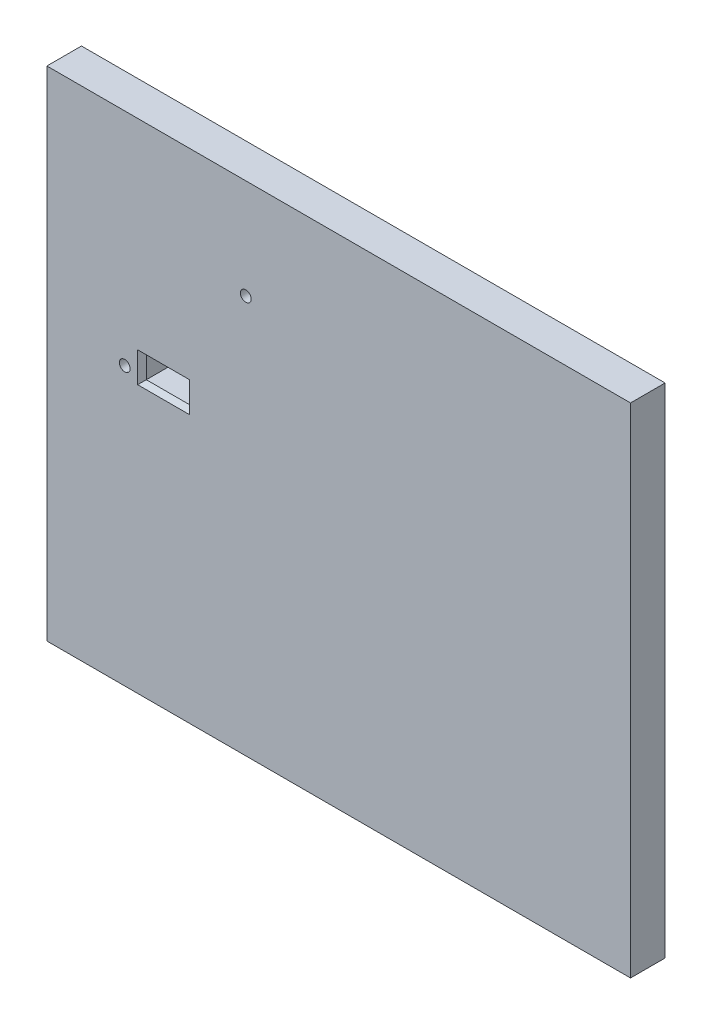
ISO-10303-21;
HEADER;
FILE_DESCRIPTION(('STEP AP214'),'2;1');
FILE_NAME('part.step','',(''),(''),'','','');
FILE_SCHEMA(('AUTOMOTIVE_DESIGN { 1 0 10303 214 1 1 1 1 }'));
ENDSEC;
DATA;
#1=APPLICATION_CONTEXT('core data for automotive mechanical design processes');
#2=APPLICATION_PROTOCOL_DEFINITION('international standard','automotive_design',2000,#1);
#3=PRODUCT_CONTEXT('',#1,'mechanical');
#4=PRODUCT('Part','Part','',(#3));
#5=PRODUCT_RELATED_PRODUCT_CATEGORY('part','',(#4));
#6=PRODUCT_DEFINITION_FORMATION('','',#4);
#7=PRODUCT_DEFINITION_CONTEXT('part definition',#1,'design');
#8=PRODUCT_DEFINITION('design','',#6,#7);
#9=PRODUCT_DEFINITION_SHAPE('','',#8);
#10=(LENGTH_UNIT() NAMED_UNIT(*) SI_UNIT(.MILLI.,.METRE.));
#11=(NAMED_UNIT(*) PLANE_ANGLE_UNIT() SI_UNIT($,.RADIAN.));
#12=(NAMED_UNIT(*) SI_UNIT($,.STERADIAN.) SOLID_ANGLE_UNIT());
#13=UNCERTAINTY_MEASURE_WITH_UNIT(LENGTH_MEASURE(1.E-05),#10,'distance_accuracy_value','');
#14=(GEOMETRIC_REPRESENTATION_CONTEXT(3) GLOBAL_UNCERTAINTY_ASSIGNED_CONTEXT((#13)) GLOBAL_UNIT_ASSIGNED_CONTEXT((#10,
#11,#12)) REPRESENTATION_CONTEXT('',''));
#15=CARTESIAN_POINT('',(0.,0.,0.));
#16=DIRECTION('',(0.,0.,1.));
#17=DIRECTION('',(1.,0.,0.));
#18=AXIS2_PLACEMENT_3D('',#15,#16,#17);
#19=CARTESIAN_POINT('',(0.,-20.,73.));
#20=DIRECTION('',(0.,-1.,0.));
#21=DIRECTION('',(1.,0.,0.));
#22=AXIS2_PLACEMENT_3D('',#19,#20,#21);
#23=PLANE('',#22);
#24=DIRECTION('',(-1.,0.,0.));
#25=VECTOR('',#24,1.);
#26=CARTESIAN_POINT('',(0.,-20.,65.));
#27=LINE('',#26,#25);
#28=CARTESIAN_POINT('',(67.5,-20.,65.));
#29=VERTEX_POINT('',#28);
#30=CARTESIAN_POINT('',(-67.5,-20.,65.));
#31=VERTEX_POINT('',#30);
#32=EDGE_CURVE('E150',#29,#31,#27,.T.);
#33=ORIENTED_EDGE('',*,*,#32,.F.);
#34=DIRECTION('',(0.,0.,-1.));
#35=VECTOR('',#34,1.);
#36=CARTESIAN_POINT('',(67.5,-20.,73.));
#37=LINE('',#36,#35);
#38=CARTESIAN_POINT('',(67.5,-20.,73.));
#39=VERTEX_POINT('',#38);
#40=EDGE_CURVE('E179',#39,#29,#37,.T.);
#41=ORIENTED_EDGE('',*,*,#40,.F.);
#42=DIRECTION('',(-1.,0.,0.));
#43=VECTOR('',#42,1.);
#44=CARTESIAN_POINT('',(0.,-20.,73.));
#45=LINE('',#44,#43);
#46=CARTESIAN_POINT('',(-67.5,-20.,73.));
#47=VERTEX_POINT('',#46);
#48=EDGE_CURVE('E155',#39,#47,#45,.T.);
#49=ORIENTED_EDGE('',*,*,#48,.T.);
#50=DIRECTION('',(0.,0.,-1.));
#51=VECTOR('',#50,1.);
#52=CARTESIAN_POINT('',(-67.5,-20.,73.));
#53=LINE('',#52,#51);
#54=EDGE_CURVE('E168',#47,#31,#53,.T.);
#55=ORIENTED_EDGE('',*,*,#54,.T.);
#56=EDGE_LOOP('',(#33,#41,#49,#55));
#57=FACE_BOUND('',#56,.T.);
#58=ADVANCED_FACE('F41',(#57),#23,.T.);
#59=CARTESIAN_POINT('',(67.5,0.,73.));
#60=DIRECTION('',(1.,0.,0.));
#61=DIRECTION('',(0.,1.,0.));
#62=AXIS2_PLACEMENT_3D('',#59,#60,#61);
#63=PLANE('',#62);
#64=DIRECTION('',(0.,-1.,0.));
#65=VECTOR('',#64,1.);
#66=CARTESIAN_POINT('',(67.5,0.,65.));
#67=LINE('',#66,#65);
#68=CARTESIAN_POINT('',(67.5,95.1987948208455,65.));
#69=VERTEX_POINT('',#68);
#70=EDGE_CURVE('E159',#69,#29,#67,.T.);
#71=ORIENTED_EDGE('',*,*,#70,.F.);
#72=DIRECTION('',(0.,0.,-1.));
#73=VECTOR('',#72,1.);
#74=CARTESIAN_POINT('',(67.5,95.1987948208455,73.));
#75=LINE('',#74,#73);
#76=CARTESIAN_POINT('',(67.5,95.1987948208455,73.));
#77=VERTEX_POINT('',#76);
#78=EDGE_CURVE('E182',#77,#69,#75,.T.);
#79=ORIENTED_EDGE('',*,*,#78,.F.);
#80=DIRECTION('',(0.,-1.,0.));
#81=VECTOR('',#80,1.);
#82=CARTESIAN_POINT('',(67.5,0.,73.));
#83=LINE('',#82,#81);
#84=EDGE_CURVE('E165',#77,#39,#83,.T.);
#85=ORIENTED_EDGE('',*,*,#84,.T.);
#86=ORIENTED_EDGE('',*,*,#40,.T.);
#87=EDGE_LOOP('',(#71,#79,#85,#86));
#88=FACE_BOUND('',#87,.T.);
#89=ADVANCED_FACE('F241',(#88),#63,.T.);
#90=CARTESIAN_POINT('',(0.,95.1987948208455,73.));
#91=DIRECTION('',(0.,1.,0.));
#92=DIRECTION('',(-1.,0.,0.));
#93=AXIS2_PLACEMENT_3D('',#90,#91,#92);
#94=PLANE('',#93);
#95=DIRECTION('',(1.,0.,0.));
#96=VECTOR('',#95,1.);
#97=CARTESIAN_POINT('',(0.,95.1987948208455,65.));
#98=LINE('',#97,#96);
#99=CARTESIAN_POINT('',(-67.5,95.1987948208455,65.));
#100=VERTEX_POINT('',#99);
#101=EDGE_CURVE('E174',#100,#69,#98,.T.);
#102=ORIENTED_EDGE('',*,*,#101,.F.);
#103=DIRECTION('',(0.,0.,-1.));
#104=VECTOR('',#103,1.);
#105=CARTESIAN_POINT('',(-67.5,95.1987948208455,73.));
#106=LINE('',#105,#104);
#107=CARTESIAN_POINT('',(-67.5,95.1987948208455,73.));
#108=VERTEX_POINT('',#107);
#109=EDGE_CURVE('E184',#108,#100,#106,.T.);
#110=ORIENTED_EDGE('',*,*,#109,.F.);
#111=DIRECTION('',(1.,0.,0.));
#112=VECTOR('',#111,1.);
#113=CARTESIAN_POINT('',(0.,95.1987948208455,73.));
#114=LINE('',#113,#112);
#115=EDGE_CURVE('E162',#108,#77,#114,.T.);
#116=ORIENTED_EDGE('',*,*,#115,.T.);
#117=ORIENTED_EDGE('',*,*,#78,.T.);
#118=EDGE_LOOP('',(#102,#110,#116,#117));
#119=FACE_BOUND('',#118,.T.);
#120=ADVANCED_FACE('F245',(#119),#94,.T.);
#121=CARTESIAN_POINT('',(-67.5,0.,73.));
#122=DIRECTION('',(-1.,0.,0.));
#123=DIRECTION('',(0.,0.,1.));
#124=AXIS2_PLACEMENT_3D('',#121,#122,#123);
#125=PLANE('',#124);
#126=DIRECTION('',(0.,1.,0.));
#127=VECTOR('',#126,1.);
#128=CARTESIAN_POINT('',(-67.5,0.,65.));
#129=LINE('',#128,#127);
#130=EDGE_CURVE('E171',#31,#100,#129,.T.);
#131=ORIENTED_EDGE('',*,*,#130,.F.);
#132=ORIENTED_EDGE('',*,*,#54,.F.);
#133=DIRECTION('',(0.,1.,0.));
#134=VECTOR('',#133,1.);
#135=CARTESIAN_POINT('',(-67.5,0.,73.));
#136=LINE('',#135,#134);
#137=EDGE_CURVE('E158',#47,#108,#136,.T.);
#138=ORIENTED_EDGE('',*,*,#137,.T.);
#139=ORIENTED_EDGE('',*,*,#109,.T.);
#140=EDGE_LOOP('',(#131,#132,#138,#139));
#141=FACE_BOUND('',#140,.T.);
#142=ADVANCED_FACE('F230',(#141),#125,.T.);
#143=CARTESIAN_POINT('',(0.,0.,73.));
#144=DIRECTION('',(0.,0.,-1.));
#145=DIRECTION('',(-1.,0.,0.));
#146=AXIS2_PLACEMENT_3D('',#143,#144,#145);
#147=PLANE('',#146);
#148=DIRECTION('',(1.,0.,0.));
#149=VECTOR('',#148,1.);
#150=CARTESIAN_POINT('',(0.,48.846,73.));
#151=LINE('',#150,#149);
#152=CARTESIAN_POINT('',(-46.5,48.846,73.));
#153=VERTEX_POINT('',#152);
#154=CARTESIAN_POINT('',(-34.5,48.846,73.));
#155=VERTEX_POINT('',#154);
#156=EDGE_CURVE('E189',#153,#155,#151,.T.);
#157=ORIENTED_EDGE('',*,*,#156,.T.);
#158=DIRECTION('',(0.,-1.,0.));
#159=VECTOR('',#158,1.);
#160=CARTESIAN_POINT('',(-34.5,0.,73.));
#161=LINE('',#160,#159);
#162=CARTESIAN_POINT('',(-34.5,41.846,73.));
#163=VERTEX_POINT('',#162);
#164=EDGE_CURVE('E195',#155,#163,#161,.T.);
#165=ORIENTED_EDGE('',*,*,#164,.T.);
#166=DIRECTION('',(-1.,0.,0.));
#167=VECTOR('',#166,1.);
#168=CARTESIAN_POINT('',(0.,41.846,73.));
#169=LINE('',#168,#167);
#170=CARTESIAN_POINT('',(-46.5,41.846,73.));
#171=VERTEX_POINT('',#170);
#172=EDGE_CURVE('E193',#163,#171,#169,.T.);
#173=ORIENTED_EDGE('',*,*,#172,.T.);
#174=DIRECTION('',(0.,1.,0.));
#175=VECTOR('',#174,1.);
#176=CARTESIAN_POINT('',(-46.5000000000001,0.,73.));
#177=LINE('',#176,#175);
#178=EDGE_CURVE('E191',#171,#153,#177,.T.);
#179=ORIENTED_EDGE('',*,*,#178,.T.);
#180=EDGE_LOOP('',(#157,#165,#173,#179));
#181=FACE_BOUND('',#180,.T.);
#182=CARTESIAN_POINT('',(-21.5,72.116,73.));
#183=DIRECTION('',(0.,0.,1.));
#184=DIRECTION('',(1.,0.,0.));
#185=AXIS2_PLACEMENT_3D('',#182,#183,#184);
#186=CIRCLE('',#185,1.25);
#187=CARTESIAN_POINT('',(-20.25,72.116,73.));
#188=VERTEX_POINT('',#187);
#189=EDGE_CURVE('E140',#188,#188,#186,.T.);
#190=ORIENTED_EDGE('',*,*,#189,.F.);
#191=EDGE_LOOP('',(#190));
#192=FACE_BOUND('',#191,.T.);
#193=CARTESIAN_POINT('',(-49.5,44.176,73.));
#194=DIRECTION('',(0.,0.,1.));
#195=DIRECTION('',(1.,0.,0.));
#196=AXIS2_PLACEMENT_3D('',#193,#194,#195);
#197=CIRCLE('',#196,1.25);
#198=CARTESIAN_POINT('',(-48.25,44.176,73.));
#199=VERTEX_POINT('',#198);
#200=EDGE_CURVE('E215',#199,#199,#197,.T.);
#201=ORIENTED_EDGE('',*,*,#200,.F.);
#202=EDGE_LOOP('',(#201));
#203=FACE_BOUND('',#202,.T.);
#204=ORIENTED_EDGE('',*,*,#48,.F.);
#205=ORIENTED_EDGE('',*,*,#84,.F.);
#206=ORIENTED_EDGE('',*,*,#115,.F.);
#207=ORIENTED_EDGE('',*,*,#137,.F.);
#208=EDGE_LOOP('',(#204,#205,#206,#207));
#209=FACE_BOUND('',#208,.T.);
#210=ADVANCED_FACE('F227',(#181,#192,#203,#209),#147,.F.);
#211=CARTESIAN_POINT('',(0.,0.,65.));
#212=DIRECTION('',(0.,0.,-1.));
#213=DIRECTION('',(-1.,0.,0.));
#214=AXIS2_PLACEMENT_3D('',#211,#212,#213);
#215=PLANE('',#214);
#216=CARTESIAN_POINT('',(-21.5,72.116,65.));
#217=DIRECTION('',(0.,0.,1.));
#218=DIRECTION('',(1.,0.,0.));
#219=AXIS2_PLACEMENT_3D('',#216,#217,#218);
#220=CIRCLE('',#219,1.25);
#221=CARTESIAN_POINT('',(-20.25,72.116,65.));
#222=VERTEX_POINT('',#221);
#223=EDGE_CURVE('E137',#222,#222,#220,.T.);
#224=ORIENTED_EDGE('',*,*,#223,.T.);
#225=EDGE_LOOP('',(#224));
#226=FACE_BOUND('',#225,.T.);
#227=CARTESIAN_POINT('',(-49.5,44.176,65.));
#228=DIRECTION('',(0.,0.,1.));
#229=DIRECTION('',(1.,0.,0.));
#230=AXIS2_PLACEMENT_3D('',#227,#228,#229);
#231=CIRCLE('',#230,1.25);
#232=CARTESIAN_POINT('',(-48.25,44.176,65.));
#233=VERTEX_POINT('',#232);
#234=EDGE_CURVE('E143',#233,#233,#231,.T.);
#235=ORIENTED_EDGE('',*,*,#234,.T.);
#236=EDGE_LOOP('',(#235));
#237=FACE_BOUND('',#236,.T.);
#238=DIRECTION('',(-1.,0.,0.));
#239=VECTOR('',#238,1.);
#240=CARTESIAN_POINT('',(-45.5,47.846,65.));
#241=LINE('',#240,#239);
#242=CARTESIAN_POINT('',(-35.5,47.846,65.));
#243=VERTEX_POINT('',#242);
#244=CARTESIAN_POINT('',(-45.5,47.846,65.));
#245=VERTEX_POINT('',#244);
#246=EDGE_CURVE('E122',#243,#245,#241,.T.);
#247=ORIENTED_EDGE('',*,*,#246,.T.);
#248=DIRECTION('',(0.,-1.,0.));
#249=VECTOR('',#248,1.);
#250=CARTESIAN_POINT('',(-45.5,47.846,65.));
#251=LINE('',#250,#249);
#252=CARTESIAN_POINT('',(-45.5,42.846,65.));
#253=VERTEX_POINT('',#252);
#254=EDGE_CURVE('E128',#245,#253,#251,.T.);
#255=ORIENTED_EDGE('',*,*,#254,.T.);
#256=DIRECTION('',(1.,0.,0.));
#257=VECTOR('',#256,1.);
#258=CARTESIAN_POINT('',(-45.5,42.846,65.));
#259=LINE('',#258,#257);
#260=CARTESIAN_POINT('',(-35.5,42.846,65.));
#261=VERTEX_POINT('',#260);
#262=EDGE_CURVE('E132',#253,#261,#259,.T.);
#263=ORIENTED_EDGE('',*,*,#262,.T.);
#264=DIRECTION('',(0.,1.,0.));
#265=VECTOR('',#264,1.);
#266=CARTESIAN_POINT('',(-35.5,47.846,65.));
#267=LINE('',#266,#265);
#268=EDGE_CURVE('E125',#261,#243,#267,.T.);
#269=ORIENTED_EDGE('',*,*,#268,.T.);
#270=EDGE_LOOP('',(#247,#255,#263,#269));
#271=FACE_BOUND('',#270,.T.);
#272=ORIENTED_EDGE('',*,*,#32,.T.);
#273=ORIENTED_EDGE('',*,*,#130,.T.);
#274=ORIENTED_EDGE('',*,*,#101,.T.);
#275=ORIENTED_EDGE('',*,*,#70,.T.);
#276=EDGE_LOOP('',(#272,#273,#274,#275));
#277=FACE_BOUND('',#276,.T.);
#278=ADVANCED_FACE('F134',(#226,#237,#271,#277),#215,.T.);
#279=CARTESIAN_POINT('',(-45.5,47.846,65.));
#280=DIRECTION('',(0.,1.,0.));
#281=DIRECTION('',(0.,0.,1.));
#282=AXIS2_PLACEMENT_3D('',#279,#280,#281);
#283=PLANE('',#282);
#284=DIRECTION('',(0.,0.,1.));
#285=VECTOR('',#284,1.);
#286=CARTESIAN_POINT('',(-35.5,47.846,65.));
#287=LINE('',#286,#285);
#288=CARTESIAN_POINT('',(-35.5,47.846,72.));
#289=VERTEX_POINT('',#288);
#290=EDGE_CURVE('E148',#243,#289,#287,.T.);
#291=ORIENTED_EDGE('',*,*,#290,.T.);
#292=DIRECTION('',(-1.,0.,0.));
#293=VECTOR('',#292,1.);
#294=CARTESIAN_POINT('',(-45.5,47.846,72.));
#295=LINE('',#294,#293);
#296=CARTESIAN_POINT('',(-45.5,47.846,72.));
#297=VERTEX_POINT('',#296);
#298=EDGE_CURVE('E11',#289,#297,#295,.T.);
#299=ORIENTED_EDGE('',*,*,#298,.T.);
#300=DIRECTION('',(0.,0.,1.));
#301=VECTOR('',#300,1.);
#302=CARTESIAN_POINT('',(-45.5,47.846,65.));
#303=LINE('',#302,#301);
#304=EDGE_CURVE('E118',#245,#297,#303,.T.);
#305=ORIENTED_EDGE('',*,*,#304,.F.);
#306=ORIENTED_EDGE('',*,*,#246,.F.);
#307=EDGE_LOOP('',(#291,#299,#305,#306));
#308=FACE_BOUND('',#307,.T.);
#309=ADVANCED_FACE('F120',(#308),#283,.F.);
#310=CARTESIAN_POINT('',(-35.5,47.846,65.));
#311=DIRECTION('',(1.,0.,0.));
#312=DIRECTION('',(0.,0.,-1.));
#313=AXIS2_PLACEMENT_3D('',#310,#311,#312);
#314=PLANE('',#313);
#315=DIRECTION('',(0.,0.,1.));
#316=VECTOR('',#315,1.);
#317=CARTESIAN_POINT('',(-35.5,42.846,65.));
#318=LINE('',#317,#316);
#319=CARTESIAN_POINT('',(-35.5,42.846,72.));
#320=VERTEX_POINT('',#319);
#321=EDGE_CURVE('E151',#261,#320,#318,.T.);
#322=ORIENTED_EDGE('',*,*,#321,.T.);
#323=DIRECTION('',(0.,1.,0.));
#324=VECTOR('',#323,1.);
#325=CARTESIAN_POINT('',(-35.5,47.846,72.));
#326=LINE('',#325,#324);
#327=EDGE_CURVE('E181',#320,#289,#326,.T.);
#328=ORIENTED_EDGE('',*,*,#327,.T.);
#329=ORIENTED_EDGE('',*,*,#290,.F.);
#330=ORIENTED_EDGE('',*,*,#268,.F.);
#331=EDGE_LOOP('',(#322,#328,#329,#330));
#332=FACE_BOUND('',#331,.T.);
#333=ADVANCED_FACE('F256',(#332),#314,.F.);
#334=CARTESIAN_POINT('',(-45.5,42.846,65.));
#335=DIRECTION('',(0.,-1.,0.));
#336=DIRECTION('',(0.,0.,-1.));
#337=AXIS2_PLACEMENT_3D('',#334,#335,#336);
#338=PLANE('',#337);
#339=DIRECTION('',(0.,0.,1.));
#340=VECTOR('',#339,1.);
#341=CARTESIAN_POINT('',(-45.5,42.846,65.));
#342=LINE('',#341,#340);
#343=CARTESIAN_POINT('',(-45.5,42.846,72.));
#344=VERTEX_POINT('',#343);
#345=EDGE_CURVE('E124',#253,#344,#342,.T.);
#346=ORIENTED_EDGE('',*,*,#345,.T.);
#347=DIRECTION('',(1.,0.,0.));
#348=VECTOR('',#347,1.);
#349=CARTESIAN_POINT('',(-45.5,42.846,72.));
#350=LINE('',#349,#348);
#351=EDGE_CURVE('E198',#344,#320,#350,.T.);
#352=ORIENTED_EDGE('',*,*,#351,.T.);
#353=ORIENTED_EDGE('',*,*,#321,.F.);
#354=ORIENTED_EDGE('',*,*,#262,.F.);
#355=EDGE_LOOP('',(#346,#352,#353,#354));
#356=FACE_BOUND('',#355,.T.);
#357=ADVANCED_FACE('F301',(#356),#338,.F.);
#358=CARTESIAN_POINT('',(-45.5,47.846,65.));
#359=DIRECTION('',(-1.,0.,0.));
#360=DIRECTION('',(0.,-1.,0.));
#361=AXIS2_PLACEMENT_3D('',#358,#359,#360);
#362=PLANE('',#361);
#363=ORIENTED_EDGE('',*,*,#304,.T.);
#364=DIRECTION('',(0.,-1.,0.));
#365=VECTOR('',#364,1.);
#366=CARTESIAN_POINT('',(-45.5,47.846,72.));
#367=LINE('',#366,#365);
#368=EDGE_CURVE('E51',#297,#344,#367,.T.);
#369=ORIENTED_EDGE('',*,*,#368,.T.);
#370=ORIENTED_EDGE('',*,*,#345,.F.);
#371=ORIENTED_EDGE('',*,*,#254,.F.);
#372=EDGE_LOOP('',(#363,#369,#370,#371));
#373=FACE_BOUND('',#372,.T.);
#374=ADVANCED_FACE('F129',(#373),#362,.F.);
#375=CARTESIAN_POINT('',(-49.5,44.176,65.));
#376=DIRECTION('',(0.,0.,1.));
#377=DIRECTION('',(1.,0.,0.));
#378=AXIS2_PLACEMENT_3D('',#375,#376,#377);
#379=CYLINDRICAL_SURFACE('',#378,1.25);
#380=ORIENTED_EDGE('',*,*,#234,.F.);
#381=EDGE_LOOP('',(#380));
#382=FACE_BOUND('',#381,.T.);
#383=ORIENTED_EDGE('',*,*,#200,.T.);
#384=EDGE_LOOP('',(#383));
#385=FACE_BOUND('',#384,.T.);
#386=ADVANCED_FACE('F292',(#382,#385),#379,.F.);
#387=CARTESIAN_POINT('',(-21.5,72.116,65.));
#388=DIRECTION('',(0.,0.,1.));
#389=DIRECTION('',(1.,0.,0.));
#390=AXIS2_PLACEMENT_3D('',#387,#388,#389);
#391=CYLINDRICAL_SURFACE('',#390,1.25);
#392=ORIENTED_EDGE('',*,*,#223,.F.);
#393=EDGE_LOOP('',(#392));
#394=FACE_BOUND('',#393,.T.);
#395=ORIENTED_EDGE('',*,*,#189,.T.);
#396=EDGE_LOOP('',(#395));
#397=FACE_BOUND('',#396,.T.);
#398=ADVANCED_FACE('F225',(#394,#397),#391,.F.);
#399=CARTESIAN_POINT('',(-45.5,47.846,72.));
#400=DIRECTION('',(-0.707106781186549,0.,-0.707106781186546));
#401=DIRECTION('',(0.,-1.,0.));
#402=AXIS2_PLACEMENT_3D('',#399,#400,#401);
#403=PLANE('',#402);
#404=DIRECTION('',(0.577350269189624,-0.577350269189627,-0.577350269189627));
#405=VECTOR('',#404,1.);
#406=CARTESIAN_POINT('',(-45.5,47.846,72.));
#407=LINE('',#406,#405);
#408=EDGE_CURVE('E204',#153,#297,#407,.T.);
#409=ORIENTED_EDGE('',*,*,#408,.F.);
#410=ORIENTED_EDGE('',*,*,#178,.F.);
#411=DIRECTION('',(0.577350269189625,0.577350269189626,-0.577350269189626));
#412=VECTOR('',#411,1.);
#413=CARTESIAN_POINT('',(-45.5,42.846,72.));
#414=LINE('',#413,#412);
#415=EDGE_CURVE('E46',#344,#171,#414,.F.);
#416=ORIENTED_EDGE('',*,*,#415,.F.);
#417=ORIENTED_EDGE('',*,*,#368,.F.);
#418=EDGE_LOOP('',(#409,#410,#416,#417));
#419=FACE_BOUND('',#418,.T.);
#420=ADVANCED_FACE('F44',(#419),#403,.F.);
#421=CARTESIAN_POINT('',(-45.5,42.846,72.));
#422=DIRECTION('',(0.,-0.707106781186547,-0.707106781186547));
#423=DIRECTION('',(1.,0.,0.));
#424=AXIS2_PLACEMENT_3D('',#421,#422,#423);
#425=PLANE('',#424);
#426=ORIENTED_EDGE('',*,*,#415,.T.);
#427=ORIENTED_EDGE('',*,*,#172,.F.);
#428=DIRECTION('',(-0.577350269189626,0.577350269189626,-0.577350269189626));
#429=VECTOR('',#428,1.);
#430=CARTESIAN_POINT('',(-37.1666666666667,44.5126666666667,70.3333333333333));
#431=LINE('',#430,#429);
#432=EDGE_CURVE('E203',#320,#163,#431,.F.);
#433=ORIENTED_EDGE('',*,*,#432,.F.);
#434=ORIENTED_EDGE('',*,*,#351,.F.);
#435=EDGE_LOOP('',(#426,#427,#433,#434));
#436=FACE_BOUND('',#435,.T.);
#437=ADVANCED_FACE('F280',(#436),#425,.F.);
#438=CARTESIAN_POINT('',(-45.5,47.846,72.));
#439=DIRECTION('',(0.,0.707106781186547,-0.707106781186547));
#440=DIRECTION('',(-1.,0.,0.));
#441=AXIS2_PLACEMENT_3D('',#438,#439,#440);
#442=PLANE('',#441);
#443=ORIENTED_EDGE('',*,*,#408,.T.);
#444=ORIENTED_EDGE('',*,*,#298,.F.);
#445=DIRECTION('',(0.577350269189626,0.577350269189626,0.577350269189626));
#446=VECTOR('',#445,1.);
#447=CARTESIAN_POINT('',(-35.5,47.846,72.));
#448=LINE('',#447,#446);
#449=EDGE_CURVE('E201',#155,#289,#448,.F.);
#450=ORIENTED_EDGE('',*,*,#449,.F.);
#451=ORIENTED_EDGE('',*,*,#156,.F.);
#452=EDGE_LOOP('',(#443,#444,#450,#451));
#453=FACE_BOUND('',#452,.T.);
#454=ADVANCED_FACE('F274',(#453),#442,.F.);
#455=CARTESIAN_POINT('',(-35.5,47.846,72.));
#456=DIRECTION('',(0.707106781186547,0.,-0.707106781186547));
#457=DIRECTION('',(0.,1.,0.));
#458=AXIS2_PLACEMENT_3D('',#455,#456,#457);
#459=PLANE('',#458);
#460=ORIENTED_EDGE('',*,*,#432,.T.);
#461=ORIENTED_EDGE('',*,*,#164,.F.);
#462=ORIENTED_EDGE('',*,*,#449,.T.);
#463=ORIENTED_EDGE('',*,*,#327,.F.);
#464=EDGE_LOOP('',(#460,#461,#462,#463));
#465=FACE_BOUND('',#464,.T.);
#466=ADVANCED_FACE('F268',(#465),#459,.F.);
#467=CLOSED_SHELL('',(#58,#89,#120,#142,#210,#278,#309,#333,#357,#374,#386,#398,#420,#437,#454,#466));
#468=MANIFOLD_SOLID_BREP('B2',#467);
#469=ADVANCED_BREP_SHAPE_REPRESENTATION('',(#18,#468),#14);
#470=SHAPE_DEFINITION_REPRESENTATION(#9,#469);
ENDSEC;
END-ISO-10303-21;
